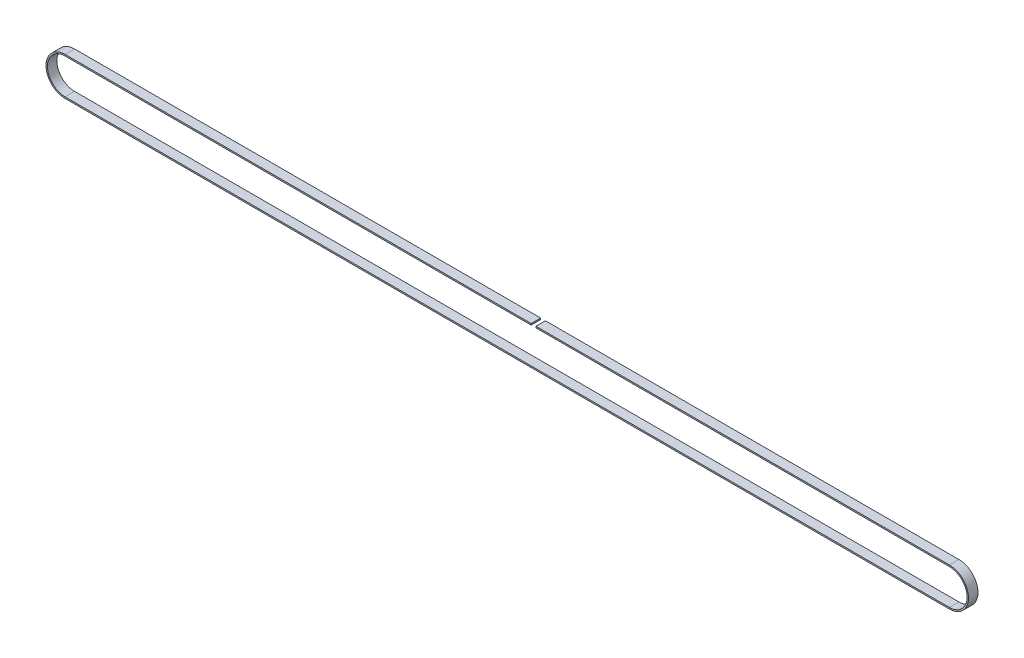
ISO-10303-21;
HEADER;
FILE_DESCRIPTION(('STEP AP214'),'2;1');
FILE_NAME('part.step','',(''),(''),'','','');
FILE_SCHEMA(('AUTOMOTIVE_DESIGN { 1 0 10303 214 1 1 1 1 }'));
ENDSEC;
DATA;
#1=APPLICATION_CONTEXT('core data for automotive mechanical design processes');
#2=APPLICATION_PROTOCOL_DEFINITION('international standard','automotive_design',2000,#1);
#3=PRODUCT_CONTEXT('',#1,'mechanical');
#4=PRODUCT('Part','Part','',(#3));
#5=PRODUCT_RELATED_PRODUCT_CATEGORY('part','',(#4));
#6=PRODUCT_DEFINITION_FORMATION('','',#4);
#7=PRODUCT_DEFINITION_CONTEXT('part definition',#1,'design');
#8=PRODUCT_DEFINITION('design','',#6,#7);
#9=PRODUCT_DEFINITION_SHAPE('','',#8);
#10=(LENGTH_UNIT() NAMED_UNIT(*) SI_UNIT(.MILLI.,.METRE.));
#11=(NAMED_UNIT(*) PLANE_ANGLE_UNIT() SI_UNIT($,.RADIAN.));
#12=(NAMED_UNIT(*) SI_UNIT($,.STERADIAN.) SOLID_ANGLE_UNIT());
#13=UNCERTAINTY_MEASURE_WITH_UNIT(LENGTH_MEASURE(1.E-05),#10,'distance_accuracy_value','');
#14=(GEOMETRIC_REPRESENTATION_CONTEXT(3) GLOBAL_UNCERTAINTY_ASSIGNED_CONTEXT((#13)) GLOBAL_UNIT_ASSIGNED_CONTEXT((#10,
#11,#12)) REPRESENTATION_CONTEXT('',''));
#15=CARTESIAN_POINT('',(0.,0.,0.));
#16=DIRECTION('',(0.,0.,1.));
#17=DIRECTION('',(1.,0.,0.));
#18=AXIS2_PLACEMENT_3D('',#15,#16,#17);
#19=CARTESIAN_POINT('',(-466.,20.12,10.));
#20=DIRECTION('',(0.,-1.,0.));
#21=DIRECTION('',(0.,0.,-1.));
#22=AXIS2_PLACEMENT_3D('',#19,#20,#21);
#23=PLANE('',#22);
#24=DIRECTION('',(-1.,0.,0.));
#25=VECTOR('',#24,1.);
#26=CARTESIAN_POINT('',(-466.,20.12,10.));
#27=LINE('',#26,#25);
#28=CARTESIAN_POINT('',(25.1776562094005,20.12,10.));
#29=VERTEX_POINT('',#28);
#30=CARTESIAN_POINT('',(-466.,20.12,10.));
#31=VERTEX_POINT('',#30);
#32=EDGE_CURVE('E185',#29,#31,#27,.T.);
#33=ORIENTED_EDGE('',*,*,#32,.F.);
#34=DIRECTION('',(0.,0.,1.));
#35=VECTOR('',#34,1.);
#36=CARTESIAN_POINT('',(25.1776562094005,20.12,10.));
#37=LINE('',#36,#35);
#38=CARTESIAN_POINT('',(25.1776562094005,20.12,0.));
#39=VERTEX_POINT('',#38);
#40=EDGE_CURVE('E137',#39,#29,#37,.T.);
#41=ORIENTED_EDGE('',*,*,#40,.F.);
#42=DIRECTION('',(-1.,0.,0.));
#43=VECTOR('',#42,1.);
#44=CARTESIAN_POINT('',(-466.,20.12,0.));
#45=LINE('',#44,#43);
#46=CARTESIAN_POINT('',(-466.,20.12,0.));
#47=VERTEX_POINT('',#46);
#48=EDGE_CURVE('E194',#39,#47,#45,.T.);
#49=ORIENTED_EDGE('',*,*,#48,.T.);
#50=DIRECTION('',(0.,0.,-1.));
#51=VECTOR('',#50,1.);
#52=CARTESIAN_POINT('',(-466.,20.12,10.));
#53=LINE('',#52,#51);
#54=EDGE_CURVE('E187',#31,#47,#53,.T.);
#55=ORIENTED_EDGE('',*,*,#54,.F.);
#56=EDGE_LOOP('',(#33,#41,#49,#55));
#57=FACE_BOUND('',#56,.T.);
#58=ADVANCED_FACE('F33',(#57),#23,.F.);
#59=CARTESIAN_POINT('',(-466.,18.62,10.));
#60=DIRECTION('',(0.,-1.,0.));
#61=DIRECTION('',(0.,0.,-1.));
#62=AXIS2_PLACEMENT_3D('',#59,#60,#61);
#63=PLANE('',#62);
#64=DIRECTION('',(0.,0.,1.));
#65=VECTOR('',#64,1.);
#66=CARTESIAN_POINT('',(25.1776562094005,18.62,10.));
#67=LINE('',#66,#65);
#68=CARTESIAN_POINT('',(25.1776562094005,18.62,0.));
#69=VERTEX_POINT('',#68);
#70=CARTESIAN_POINT('',(25.1776562094005,18.62,10.));
#71=VERTEX_POINT('',#70);
#72=EDGE_CURVE('E219',#69,#71,#67,.T.);
#73=ORIENTED_EDGE('',*,*,#72,.T.);
#74=DIRECTION('',(-1.,0.,0.));
#75=VECTOR('',#74,1.);
#76=CARTESIAN_POINT('',(-466.,18.62,10.));
#77=LINE('',#76,#75);
#78=CARTESIAN_POINT('',(-466.,18.62,10.));
#79=VERTEX_POINT('',#78);
#80=EDGE_CURVE('E144',#71,#79,#77,.T.);
#81=ORIENTED_EDGE('',*,*,#80,.T.);
#82=DIRECTION('',(0.,0.,-1.));
#83=VECTOR('',#82,1.);
#84=CARTESIAN_POINT('',(-466.,18.62,10.));
#85=LINE('',#84,#83);
#86=CARTESIAN_POINT('',(-466.,18.62,0.));
#87=VERTEX_POINT('',#86);
#88=EDGE_CURVE('E172',#79,#87,#85,.T.);
#89=ORIENTED_EDGE('',*,*,#88,.T.);
#90=DIRECTION('',(-1.,0.,0.));
#91=VECTOR('',#90,1.);
#92=CARTESIAN_POINT('',(-466.,18.62,0.));
#93=LINE('',#92,#91);
#94=EDGE_CURVE('E158',#69,#87,#93,.T.);
#95=ORIENTED_EDGE('',*,*,#94,.F.);
#96=EDGE_LOOP('',(#73,#81,#89,#95));
#97=FACE_BOUND('',#96,.T.);
#98=ADVANCED_FACE('F235',(#97),#63,.T.);
#99=CARTESIAN_POINT('',(-466.,0.,10.));
#100=DIRECTION('',(0.,0.,1.));
#101=DIRECTION('',(1.,0.,0.));
#102=AXIS2_PLACEMENT_3D('',#99,#100,#101);
#103=PLANE('',#102);
#104=DIRECTION('',(0.,1.,0.));
#105=VECTOR('',#104,1.);
#106=CARTESIAN_POINT('',(25.1776562094005,-20.121,10.));
#107=LINE('',#106,#105);
#108=EDGE_CURVE('E48',#71,#29,#107,.T.);
#109=ORIENTED_EDGE('',*,*,#108,.T.);
#110=ORIENTED_EDGE('',*,*,#32,.T.);
#111=CARTESIAN_POINT('',(-466.,0.,10.));
#112=DIRECTION('',(0.,0.,1.));
#113=DIRECTION('',(1.,0.,0.));
#114=AXIS2_PLACEMENT_3D('',#111,#112,#113);
#115=CIRCLE('',#114,20.12);
#116=CARTESIAN_POINT('',(-466.,-20.12,10.));
#117=VERTEX_POINT('',#116);
#118=EDGE_CURVE('E177',#31,#117,#115,.T.);
#119=ORIENTED_EDGE('',*,*,#118,.T.);
#120=DIRECTION('',(1.,0.,0.));
#121=VECTOR('',#120,1.);
#122=CARTESIAN_POINT('',(-466.,-20.12,10.));
#123=LINE('',#122,#121);
#124=CARTESIAN_POINT('',(466.,-20.12,10.));
#125=VERTEX_POINT('',#124);
#126=EDGE_CURVE('E180',#117,#125,#123,.T.);
#127=ORIENTED_EDGE('',*,*,#126,.T.);
#128=CARTESIAN_POINT('',(466.,0.,10.));
#129=DIRECTION('',(0.,0.,1.));
#130=DIRECTION('',(1.,0.,0.));
#131=AXIS2_PLACEMENT_3D('',#128,#129,#130);
#132=CIRCLE('',#131,20.12);
#133=CARTESIAN_POINT('',(466.,20.12,10.));
#134=VERTEX_POINT('',#133);
#135=EDGE_CURVE('E183',#125,#134,#132,.T.);
#136=ORIENTED_EDGE('',*,*,#135,.T.);
#137=CARTESIAN_POINT('',(30.1776562094005,20.12,10.));
#138=VERTEX_POINT('',#137);
#139=EDGE_CURVE('E136',#134,#138,#27,.T.);
#140=ORIENTED_EDGE('',*,*,#139,.T.);
#141=DIRECTION('',(0.,1.,0.));
#142=VECTOR('',#141,1.);
#143=CARTESIAN_POINT('',(30.1776562094005,-20.121,10.));
#144=LINE('',#143,#142);
#145=CARTESIAN_POINT('',(30.1776562094005,18.62,10.));
#146=VERTEX_POINT('',#145);
#147=EDGE_CURVE('E122',#146,#138,#144,.T.);
#148=ORIENTED_EDGE('',*,*,#147,.F.);
#149=CARTESIAN_POINT('',(466.,18.62,10.));
#150=VERTEX_POINT('',#149);
#151=EDGE_CURVE('E134',#150,#146,#77,.T.);
#152=ORIENTED_EDGE('',*,*,#151,.F.);
#153=CARTESIAN_POINT('',(466.,0.,10.));
#154=DIRECTION('',(0.,0.,1.));
#155=DIRECTION('',(1.,0.,0.));
#156=AXIS2_PLACEMENT_3D('',#153,#154,#155);
#157=CIRCLE('',#156,18.62);
#158=CARTESIAN_POINT('',(466.,-18.62,10.));
#159=VERTEX_POINT('',#158);
#160=EDGE_CURVE('E149',#159,#150,#157,.T.);
#161=ORIENTED_EDGE('',*,*,#160,.F.);
#162=DIRECTION('',(1.,0.,0.));
#163=VECTOR('',#162,1.);
#164=CARTESIAN_POINT('',(-466.,-18.62,10.));
#165=LINE('',#164,#163);
#166=CARTESIAN_POINT('',(-466.,-18.62,10.));
#167=VERTEX_POINT('',#166);
#168=EDGE_CURVE('E147',#167,#159,#165,.T.);
#169=ORIENTED_EDGE('',*,*,#168,.F.);
#170=CARTESIAN_POINT('',(-466.,0.,10.));
#171=DIRECTION('',(0.,0.,1.));
#172=DIRECTION('',(1.,0.,0.));
#173=AXIS2_PLACEMENT_3D('',#170,#171,#172);
#174=CIRCLE('',#173,18.62);
#175=EDGE_CURVE('E143',#79,#167,#174,.T.);
#176=ORIENTED_EDGE('',*,*,#175,.F.);
#177=ORIENTED_EDGE('',*,*,#80,.F.);
#178=EDGE_LOOP('',(#109,#110,#119,#127,#136,#140,#148,#152,#161,#169,#176,#177));
#179=FACE_BOUND('',#178,.T.);
#180=ADVANCED_FACE('F132',(#179),#103,.T.);
#181=CARTESIAN_POINT('',(-466.,0.,0.));
#182=DIRECTION('',(0.,0.,1.));
#183=DIRECTION('',(1.,0.,0.));
#184=AXIS2_PLACEMENT_3D('',#181,#182,#183);
#185=PLANE('',#184);
#186=ORIENTED_EDGE('',*,*,#48,.F.);
#187=DIRECTION('',(0.,1.,0.));
#188=VECTOR('',#187,1.);
#189=CARTESIAN_POINT('',(25.1776562094005,-20.121,0.));
#190=LINE('',#189,#188);
#191=EDGE_CURVE('E127',#69,#39,#190,.T.);
#192=ORIENTED_EDGE('',*,*,#191,.F.);
#193=ORIENTED_EDGE('',*,*,#94,.T.);
#194=CARTESIAN_POINT('',(-466.,0.,0.));
#195=DIRECTION('',(0.,0.,1.));
#196=DIRECTION('',(1.,0.,0.));
#197=AXIS2_PLACEMENT_3D('',#194,#195,#196);
#198=CIRCLE('',#197,18.62);
#199=CARTESIAN_POINT('',(-466.,-18.62,0.));
#200=VERTEX_POINT('',#199);
#201=EDGE_CURVE('E162',#87,#200,#198,.T.);
#202=ORIENTED_EDGE('',*,*,#201,.T.);
#203=DIRECTION('',(1.,0.,0.));
#204=VECTOR('',#203,1.);
#205=CARTESIAN_POINT('',(-466.,-18.62,0.));
#206=LINE('',#205,#204);
#207=CARTESIAN_POINT('',(466.,-18.62,0.));
#208=VERTEX_POINT('',#207);
#209=EDGE_CURVE('E165',#200,#208,#206,.T.);
#210=ORIENTED_EDGE('',*,*,#209,.T.);
#211=CARTESIAN_POINT('',(466.,0.,0.));
#212=DIRECTION('',(0.,0.,1.));
#213=DIRECTION('',(1.,0.,0.));
#214=AXIS2_PLACEMENT_3D('',#211,#212,#213);
#215=CIRCLE('',#214,18.62);
#216=CARTESIAN_POINT('',(466.,18.62,0.));
#217=VERTEX_POINT('',#216);
#218=EDGE_CURVE('E155',#208,#217,#215,.T.);
#219=ORIENTED_EDGE('',*,*,#218,.T.);
#220=CARTESIAN_POINT('',(30.1776562094005,18.62,0.));
#221=VERTEX_POINT('',#220);
#222=EDGE_CURVE('E160',#217,#221,#93,.T.);
#223=ORIENTED_EDGE('',*,*,#222,.T.);
#224=DIRECTION('',(0.,1.,0.));
#225=VECTOR('',#224,1.);
#226=CARTESIAN_POINT('',(30.1776562094005,-20.121,0.));
#227=LINE('',#226,#225);
#228=CARTESIAN_POINT('',(30.1776562094005,20.12,0.));
#229=VERTEX_POINT('',#228);
#230=EDGE_CURVE('E56',#221,#229,#227,.T.);
#231=ORIENTED_EDGE('',*,*,#230,.T.);
#232=CARTESIAN_POINT('',(466.,20.12,0.));
#233=VERTEX_POINT('',#232);
#234=EDGE_CURVE('E181',#233,#229,#45,.T.);
#235=ORIENTED_EDGE('',*,*,#234,.F.);
#236=CARTESIAN_POINT('',(466.,0.,0.));
#237=DIRECTION('',(0.,0.,1.));
#238=DIRECTION('',(1.,0.,0.));
#239=AXIS2_PLACEMENT_3D('',#236,#237,#238);
#240=CIRCLE('',#239,20.12);
#241=CARTESIAN_POINT('',(466.,-20.12,0.));
#242=VERTEX_POINT('',#241);
#243=EDGE_CURVE('E192',#242,#233,#240,.T.);
#244=ORIENTED_EDGE('',*,*,#243,.F.);
#245=DIRECTION('',(1.,0.,0.));
#246=VECTOR('',#245,1.);
#247=CARTESIAN_POINT('',(-466.,-20.12,0.));
#248=LINE('',#247,#246);
#249=CARTESIAN_POINT('',(-466.,-20.12,0.));
#250=VERTEX_POINT('',#249);
#251=EDGE_CURVE('E190',#250,#242,#248,.T.);
#252=ORIENTED_EDGE('',*,*,#251,.F.);
#253=CARTESIAN_POINT('',(-466.,0.,0.));
#254=DIRECTION('',(0.,0.,1.));
#255=DIRECTION('',(1.,0.,0.));
#256=AXIS2_PLACEMENT_3D('',#253,#254,#255);
#257=CIRCLE('',#256,20.12);
#258=EDGE_CURVE('E176',#47,#250,#257,.T.);
#259=ORIENTED_EDGE('',*,*,#258,.F.);
#260=EDGE_LOOP('',(#186,#192,#193,#202,#210,#219,#223,#231,#235,#244,#252,#259));
#261=FACE_BOUND('',#260,.T.);
#262=ADVANCED_FACE('F212',(#261),#185,.F.);
#263=CARTESIAN_POINT('',(-466.,0.,10.));
#264=DIRECTION('',(0.,0.,-1.));
#265=DIRECTION('',(-1.,0.,0.));
#266=AXIS2_PLACEMENT_3D('',#263,#264,#265);
#267=CYLINDRICAL_SURFACE('',#266,20.12);
#268=ORIENTED_EDGE('',*,*,#258,.T.);
#269=DIRECTION('',(0.,0.,-1.));
#270=VECTOR('',#269,1.);
#271=CARTESIAN_POINT('',(-466.,-20.12,10.));
#272=LINE('',#271,#270);
#273=EDGE_CURVE('E11',#117,#250,#272,.T.);
#274=ORIENTED_EDGE('',*,*,#273,.F.);
#275=ORIENTED_EDGE('',*,*,#118,.F.);
#276=ORIENTED_EDGE('',*,*,#54,.T.);
#277=EDGE_LOOP('',(#268,#274,#275,#276));
#278=FACE_BOUND('',#277,.T.);
#279=ADVANCED_FACE('F35',(#278),#267,.T.);
#280=CARTESIAN_POINT('',(-466.,-20.12,10.));
#281=DIRECTION('',(0.,1.,0.));
#282=DIRECTION('',(0.,0.,1.));
#283=AXIS2_PLACEMENT_3D('',#280,#281,#282);
#284=PLANE('',#283);
#285=ORIENTED_EDGE('',*,*,#251,.T.);
#286=DIRECTION('',(0.,0.,-1.));
#287=VECTOR('',#286,1.);
#288=CARTESIAN_POINT('',(466.,-20.12,10.));
#289=LINE('',#288,#287);
#290=EDGE_CURVE('E41',#125,#242,#289,.T.);
#291=ORIENTED_EDGE('',*,*,#290,.F.);
#292=ORIENTED_EDGE('',*,*,#126,.F.);
#293=ORIENTED_EDGE('',*,*,#273,.T.);
#294=EDGE_LOOP('',(#285,#291,#292,#293));
#295=FACE_BOUND('',#294,.T.);
#296=ADVANCED_FACE('F231',(#295),#284,.F.);
#297=CARTESIAN_POINT('',(466.,0.,10.));
#298=DIRECTION('',(0.,0.,-1.));
#299=DIRECTION('',(-1.,0.,0.));
#300=AXIS2_PLACEMENT_3D('',#297,#298,#299);
#301=CYLINDRICAL_SURFACE('',#300,20.12);
#302=ORIENTED_EDGE('',*,*,#243,.T.);
#303=DIRECTION('',(0.,0.,-1.));
#304=VECTOR('',#303,1.);
#305=CARTESIAN_POINT('',(466.,20.12,10.));
#306=LINE('',#305,#304);
#307=EDGE_CURVE('E199',#134,#233,#306,.T.);
#308=ORIENTED_EDGE('',*,*,#307,.F.);
#309=ORIENTED_EDGE('',*,*,#135,.F.);
#310=ORIENTED_EDGE('',*,*,#290,.T.);
#311=EDGE_LOOP('',(#302,#308,#309,#310));
#312=FACE_BOUND('',#311,.T.);
#313=ADVANCED_FACE('F206',(#312),#301,.T.);
#314=ORIENTED_EDGE('',*,*,#234,.T.);
#315=DIRECTION('',(0.,0.,-1.));
#316=VECTOR('',#315,1.);
#317=CARTESIAN_POINT('',(30.1776562094005,20.12,10.));
#318=LINE('',#317,#316);
#319=EDGE_CURVE('E159',#138,#229,#318,.T.);
#320=ORIENTED_EDGE('',*,*,#319,.F.);
#321=ORIENTED_EDGE('',*,*,#139,.F.);
#322=ORIENTED_EDGE('',*,*,#307,.T.);
#323=EDGE_LOOP('',(#314,#320,#321,#322));
#324=FACE_BOUND('',#323,.T.);
#325=ADVANCED_FACE('F215',(#324),#23,.F.);
#326=CARTESIAN_POINT('',(466.,0.,10.));
#327=DIRECTION('',(0.,0.,-1.));
#328=DIRECTION('',(-1.,0.,0.));
#329=AXIS2_PLACEMENT_3D('',#326,#327,#328);
#330=CYLINDRICAL_SURFACE('',#329,18.62);
#331=ORIENTED_EDGE('',*,*,#218,.F.);
#332=DIRECTION('',(0.,0.,-1.));
#333=VECTOR('',#332,1.);
#334=CARTESIAN_POINT('',(466.,-18.62,10.));
#335=LINE('',#334,#333);
#336=EDGE_CURVE('E154',#159,#208,#335,.T.);
#337=ORIENTED_EDGE('',*,*,#336,.F.);
#338=ORIENTED_EDGE('',*,*,#160,.T.);
#339=DIRECTION('',(0.,0.,-1.));
#340=VECTOR('',#339,1.);
#341=CARTESIAN_POINT('',(466.,18.62,10.));
#342=LINE('',#341,#340);
#343=EDGE_CURVE('E142',#150,#217,#342,.T.);
#344=ORIENTED_EDGE('',*,*,#343,.T.);
#345=EDGE_LOOP('',(#331,#337,#338,#344));
#346=FACE_BOUND('',#345,.T.);
#347=ADVANCED_FACE('F246',(#346),#330,.F.);
#348=DIRECTION('',(0.,0.,-1.));
#349=VECTOR('',#348,1.);
#350=CARTESIAN_POINT('',(30.1776562094005,18.62,10.));
#351=LINE('',#350,#349);
#352=EDGE_CURVE('E119',#146,#221,#351,.T.);
#353=ORIENTED_EDGE('',*,*,#352,.T.);
#354=ORIENTED_EDGE('',*,*,#222,.F.);
#355=ORIENTED_EDGE('',*,*,#343,.F.);
#356=ORIENTED_EDGE('',*,*,#151,.T.);
#357=EDGE_LOOP('',(#353,#354,#355,#356));
#358=FACE_BOUND('',#357,.T.);
#359=ADVANCED_FACE('F140',(#358),#63,.T.);
#360=CARTESIAN_POINT('',(-466.,0.,10.));
#361=DIRECTION('',(0.,0.,-1.));
#362=DIRECTION('',(-1.,0.,0.));
#363=AXIS2_PLACEMENT_3D('',#360,#361,#362);
#364=CYLINDRICAL_SURFACE('',#363,18.62);
#365=ORIENTED_EDGE('',*,*,#201,.F.);
#366=ORIENTED_EDGE('',*,*,#88,.F.);
#367=ORIENTED_EDGE('',*,*,#175,.T.);
#368=DIRECTION('',(0.,0.,-1.));
#369=VECTOR('',#368,1.);
#370=CARTESIAN_POINT('',(-466.,-18.62,10.));
#371=LINE('',#370,#369);
#372=EDGE_CURVE('E170',#167,#200,#371,.T.);
#373=ORIENTED_EDGE('',*,*,#372,.T.);
#374=EDGE_LOOP('',(#365,#366,#367,#373));
#375=FACE_BOUND('',#374,.T.);
#376=ADVANCED_FACE('F239',(#375),#364,.F.);
#377=CARTESIAN_POINT('',(-466.,-18.62,10.));
#378=DIRECTION('',(0.,1.,0.));
#379=DIRECTION('',(0.,0.,1.));
#380=AXIS2_PLACEMENT_3D('',#377,#378,#379);
#381=PLANE('',#380);
#382=ORIENTED_EDGE('',*,*,#209,.F.);
#383=ORIENTED_EDGE('',*,*,#372,.F.);
#384=ORIENTED_EDGE('',*,*,#168,.T.);
#385=ORIENTED_EDGE('',*,*,#336,.T.);
#386=EDGE_LOOP('',(#382,#383,#384,#385));
#387=FACE_BOUND('',#386,.T.);
#388=ADVANCED_FACE('F242',(#387),#381,.T.);
#389=CARTESIAN_POINT('',(30.1776562094005,-20.121,10.));
#390=DIRECTION('',(1.,0.,0.));
#391=DIRECTION('',(0.,0.,-1.));
#392=AXIS2_PLACEMENT_3D('',#389,#390,#391);
#393=PLANE('',#392);
#394=ORIENTED_EDGE('',*,*,#147,.T.);
#395=ORIENTED_EDGE('',*,*,#319,.T.);
#396=ORIENTED_EDGE('',*,*,#230,.F.);
#397=ORIENTED_EDGE('',*,*,#352,.F.);
#398=EDGE_LOOP('',(#394,#395,#396,#397));
#399=FACE_BOUND('',#398,.T.);
#400=ADVANCED_FACE('F121',(#399),#393,.F.);
#401=CARTESIAN_POINT('',(25.1776562094005,-20.121,10.));
#402=DIRECTION('',(-1.,0.,0.));
#403=DIRECTION('',(0.,0.,1.));
#404=AXIS2_PLACEMENT_3D('',#401,#402,#403);
#405=PLANE('',#404);
#406=ORIENTED_EDGE('',*,*,#191,.T.);
#407=ORIENTED_EDGE('',*,*,#40,.T.);
#408=ORIENTED_EDGE('',*,*,#108,.F.);
#409=ORIENTED_EDGE('',*,*,#72,.F.);
#410=EDGE_LOOP('',(#406,#407,#408,#409));
#411=FACE_BOUND('',#410,.T.);
#412=ADVANCED_FACE('F344',(#411),#405,.F.);
#413=CLOSED_SHELL('',(#58,#98,#180,#262,#279,#296,#313,#325,#347,#359,#376,#388,#400,#412));
#414=MANIFOLD_SOLID_BREP('B2',#413);
#415=ADVANCED_BREP_SHAPE_REPRESENTATION('',(#18,#414),#14);
#416=SHAPE_DEFINITION_REPRESENTATION(#9,#415);
ENDSEC;
END-ISO-10303-21;
